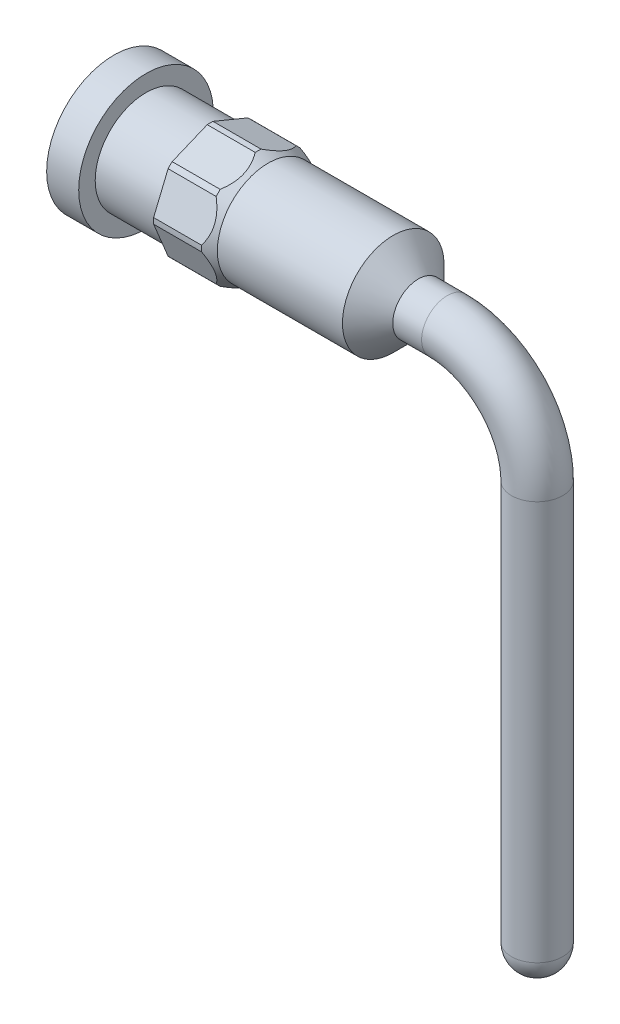
ISO-10303-21;
HEADER;
FILE_DESCRIPTION(('STEP AP214'),'2;1');
FILE_NAME('part.step','',(''),(''),'','','');
FILE_SCHEMA(('AUTOMOTIVE_DESIGN { 1 0 10303 214 1 1 1 1 }'));
ENDSEC;
DATA;
#1=APPLICATION_CONTEXT('core data for automotive mechanical design processes');
#2=APPLICATION_PROTOCOL_DEFINITION('international standard','automotive_design',2000,#1);
#3=PRODUCT_CONTEXT('',#1,'mechanical');
#4=PRODUCT('Part','Part','',(#3));
#5=PRODUCT_RELATED_PRODUCT_CATEGORY('part','',(#4));
#6=PRODUCT_DEFINITION_FORMATION('','',#4);
#7=PRODUCT_DEFINITION_CONTEXT('part definition',#1,'design');
#8=PRODUCT_DEFINITION('design','',#6,#7);
#9=PRODUCT_DEFINITION_SHAPE('','',#8);
#10=(LENGTH_UNIT() NAMED_UNIT(*) SI_UNIT(.MILLI.,.METRE.));
#11=(NAMED_UNIT(*) PLANE_ANGLE_UNIT() SI_UNIT($,.RADIAN.));
#12=(NAMED_UNIT(*) SI_UNIT($,.STERADIAN.) SOLID_ANGLE_UNIT());
#13=UNCERTAINTY_MEASURE_WITH_UNIT(LENGTH_MEASURE(1.E-05),#10,'distance_accuracy_value','');
#14=(GEOMETRIC_REPRESENTATION_CONTEXT(3) GLOBAL_UNCERTAINTY_ASSIGNED_CONTEXT((#13)) GLOBAL_UNIT_ASSIGNED_CONTEXT((#10,
#11,#12)) REPRESENTATION_CONTEXT('',''));
#15=CARTESIAN_POINT('',(0.,0.,0.));
#16=DIRECTION('',(0.,0.,1.));
#17=DIRECTION('',(1.,0.,0.));
#18=AXIS2_PLACEMENT_3D('',#15,#16,#17);
#19=CARTESIAN_POINT('',(0.,0.,0.));
#20=DIRECTION('',(-1.,0.,0.));
#21=DIRECTION('',(0.,0.,1.));
#22=AXIS2_PLACEMENT_3D('',#19,#20,#21);
#23=CYLINDRICAL_SURFACE('',#22,0.4445);
#24=CARTESIAN_POINT('',(0.,0.,0.));
#25=DIRECTION('',(-1.,0.,0.));
#26=DIRECTION('',(0.,0.,1.));
#27=AXIS2_PLACEMENT_3D('',#24,#25,#26);
#28=CIRCLE('',#27,0.4445);
#29=CARTESIAN_POINT('',(0.,0.,0.4445));
#30=VERTEX_POINT('',#29);
#31=EDGE_CURVE('E174',#30,#30,#28,.T.);
#32=ORIENTED_EDGE('',*,*,#31,.T.);
#33=EDGE_LOOP('',(#32));
#34=FACE_BOUND('',#33,.T.);
#35=CARTESIAN_POINT('',(0.000254000000005083,0.,0.));
#36=DIRECTION('',(-1.,0.,0.));
#37=DIRECTION('',(0.,0.,1.));
#38=AXIS2_PLACEMENT_3D('',#35,#36,#37);
#39=CIRCLE('',#38,0.4445);
#40=CARTESIAN_POINT('',(0.000254000000005083,0.,0.4445));
#41=VERTEX_POINT('',#40);
#42=EDGE_CURVE('E170',#41,#41,#39,.T.);
#43=ORIENTED_EDGE('',*,*,#42,.F.);
#44=EDGE_LOOP('',(#43));
#45=FACE_BOUND('',#44,.T.);
#46=ADVANCED_FACE('F16',(#34,#45),#23,.F.);
#47=CARTESIAN_POINT('',(0.000254000000005083,0.,0.));
#48=DIRECTION('',(-1.,0.,0.));
#49=DIRECTION('',(0.,0.,1.));
#50=AXIS2_PLACEMENT_3D('',#47,#48,#49);
#51=CONICAL_SURFACE('',#50,0.4445,1.15191730631627);
#52=ORIENTED_EDGE('',*,*,#42,.T.);
#53=EDGE_LOOP('',(#52));
#54=FACE_BOUND('',#53,.T.);
#55=CARTESIAN_POINT('',(0.198158150619643,0.,0.));
#56=VERTEX_POINT('',#55);
#57=VERTEX_LOOP('',#56);
#58=FACE_BOUND('',#57,.T.);
#59=ADVANCED_FACE('F355',(#54,#58),#51,.F.);
#60=CARTESIAN_POINT('',(3.35404934226463,-3.87688919235702,0.));
#61=DIRECTION('',(0.,1.,0.));
#62=DIRECTION('',(1.,0.,0.));
#63=AXIS2_PLACEMENT_3D('',#60,#61,#62);
#64=SPHERICAL_SURFACE('',#63,0.2032);
#65=CARTESIAN_POINT('',(3.35404934226463,-3.87688919235702,0.));
#66=DIRECTION('',(0.,1.,0.));
#67=DIRECTION('',(0.,0.,1.));
#68=AXIS2_PLACEMENT_3D('',#65,#66,#67);
#69=CIRCLE('',#68,0.2032);
#70=CARTESIAN_POINT('',(3.35404934226463,-3.87688919235702,0.2032));
#71=VERTEX_POINT('',#70);
#72=EDGE_CURVE('E201',#71,#71,#69,.T.);
#73=ORIENTED_EDGE('',*,*,#72,.F.);
#74=EDGE_LOOP('',(#73));
#75=FACE_BOUND('',#74,.T.);
#76=ADVANCED_FACE('F358',(#75),#64,.T.);
#77=CARTESIAN_POINT('',(0.,0.,0.));
#78=DIRECTION('',(-1.,0.,0.));
#79=DIRECTION('',(0.,0.,1.));
#80=AXIS2_PLACEMENT_3D('',#77,#78,#79);
#81=CYLINDRICAL_SURFACE('',#80,0.5334);
#82=CARTESIAN_POINT('',(0.,0.,0.));
#83=DIRECTION('',(-1.,0.,0.));
#84=DIRECTION('',(0.,0.,1.));
#85=AXIS2_PLACEMENT_3D('',#82,#83,#84);
#86=CIRCLE('',#85,0.5334);
#87=CARTESIAN_POINT('',(0.,0.,0.5334));
#88=VERTEX_POINT('',#87);
#89=EDGE_CURVE('E188',#88,#88,#86,.T.);
#90=ORIENTED_EDGE('',*,*,#89,.F.);
#91=EDGE_LOOP('',(#90));
#92=FACE_BOUND('',#91,.T.);
#93=CARTESIAN_POINT('',(0.254,0.,0.));
#94=DIRECTION('',(-1.,0.,0.));
#95=DIRECTION('',(0.,0.,1.));
#96=AXIS2_PLACEMENT_3D('',#93,#94,#95);
#97=CIRCLE('',#96,0.5334);
#98=CARTESIAN_POINT('',(0.254,0.,0.5334));
#99=VERTEX_POINT('',#98);
#100=EDGE_CURVE('E11',#99,#99,#97,.T.);
#101=ORIENTED_EDGE('',*,*,#100,.T.);
#102=EDGE_LOOP('',(#101));
#103=FACE_BOUND('',#102,.T.);
#104=ADVANCED_FACE('F362',(#92,#103),#81,.T.);
#105=CARTESIAN_POINT('',(0.,0.,0.));
#106=DIRECTION('',(-1.,0.,0.));
#107=DIRECTION('',(0.,0.,1.));
#108=AXIS2_PLACEMENT_3D('',#105,#106,#107);
#109=CYLINDRICAL_SURFACE('',#108,0.40259);
#110=CARTESIAN_POINT('',(0.254,0.,0.));
#111=DIRECTION('',(-1.,0.,0.));
#112=DIRECTION('',(0.,0.,1.));
#113=AXIS2_PLACEMENT_3D('',#110,#111,#112);
#114=CIRCLE('',#113,0.40259);
#115=CARTESIAN_POINT('',(0.254,0.,0.40259));
#116=VERTEX_POINT('',#115);
#117=EDGE_CURVE('E190',#116,#116,#114,.T.);
#118=ORIENTED_EDGE('',*,*,#117,.F.);
#119=EDGE_LOOP('',(#118));
#120=FACE_BOUND('',#119,.T.);
#121=CARTESIAN_POINT('',(0.762,0.,0.));
#122=DIRECTION('',(-1.,0.,0.));
#123=DIRECTION('',(0.,0.,1.));
#124=AXIS2_PLACEMENT_3D('',#121,#122,#123);
#125=CIRCLE('',#124,0.40259);
#126=CARTESIAN_POINT('',(0.762,0.,0.40259));
#127=VERTEX_POINT('',#126);
#128=EDGE_CURVE('E25',#127,#127,#125,.T.);
#129=ORIENTED_EDGE('',*,*,#128,.T.);
#130=EDGE_LOOP('',(#129));
#131=FACE_BOUND('',#130,.T.);
#132=ADVANCED_FACE('F366',(#120,#131),#109,.T.);
#133=CARTESIAN_POINT('',(0.,0.,0.));
#134=DIRECTION('',(-1.,0.,0.));
#135=DIRECTION('',(0.,0.,1.));
#136=AXIS2_PLACEMENT_3D('',#133,#134,#135);
#137=CYLINDRICAL_SURFACE('',#136,0.40259);
#138=CARTESIAN_POINT('',(1.22218936292205,0.,0.));
#139=DIRECTION('',(-1.,0.,0.));
#140=DIRECTION('',(0.,0.,1.));
#141=AXIS2_PLACEMENT_3D('',#138,#139,#140);
#142=CIRCLE('',#141,0.40259);
#143=CARTESIAN_POINT('',(1.22218936292205,0.,0.40259));
#144=VERTEX_POINT('',#143);
#145=EDGE_CURVE('E204',#144,#144,#142,.T.);
#146=ORIENTED_EDGE('',*,*,#145,.F.);
#147=EDGE_LOOP('',(#146));
#148=FACE_BOUND('',#147,.T.);
#149=CARTESIAN_POINT('',(2.21361000000001,0.,0.));
#150=DIRECTION('',(-1.,0.,0.));
#151=DIRECTION('',(0.,0.,1.));
#152=AXIS2_PLACEMENT_3D('',#149,#150,#151);
#153=CIRCLE('',#152,0.40259);
#154=CARTESIAN_POINT('',(2.21361000000001,0.,0.40259));
#155=VERTEX_POINT('',#154);
#156=EDGE_CURVE('E497',#155,#155,#153,.T.);
#157=ORIENTED_EDGE('',*,*,#156,.T.);
#158=EDGE_LOOP('',(#157));
#159=FACE_BOUND('',#158,.T.);
#160=ADVANCED_FACE('F369',(#148,#159),#137,.T.);
#161=CARTESIAN_POINT('',(2.413,0.,0.));
#162=DIRECTION('',(-1.,0.,0.));
#163=DIRECTION('',(0.,0.,1.));
#164=AXIS2_PLACEMENT_3D('',#161,#162,#163);
#165=CONICAL_SURFACE('',#164,0.2032,0.785398163397482);
#166=ORIENTED_EDGE('',*,*,#156,.F.);
#167=EDGE_LOOP('',(#166));
#168=FACE_BOUND('',#167,.T.);
#169=CARTESIAN_POINT('',(2.413,0.,0.));
#170=DIRECTION('',(-1.,0.,0.));
#171=DIRECTION('',(0.,0.,1.));
#172=AXIS2_PLACEMENT_3D('',#169,#170,#171);
#173=CIRCLE('',#172,0.2032);
#174=CARTESIAN_POINT('',(2.413,0.,0.2032));
#175=VERTEX_POINT('',#174);
#176=EDGE_CURVE('E494',#175,#175,#173,.T.);
#177=ORIENTED_EDGE('',*,*,#176,.T.);
#178=EDGE_LOOP('',(#177));
#179=FACE_BOUND('',#178,.T.);
#180=ADVANCED_FACE('F373',(#168,#179),#165,.T.);
#181=CARTESIAN_POINT('',(0.,0.,0.));
#182=DIRECTION('',(-1.,0.,0.));
#183=DIRECTION('',(0.,0.,1.));
#184=AXIS2_PLACEMENT_3D('',#181,#182,#183);
#185=CYLINDRICAL_SURFACE('',#184,0.2032);
#186=ORIENTED_EDGE('',*,*,#176,.F.);
#187=EDGE_LOOP('',(#186));
#188=FACE_BOUND('',#187,.T.);
#189=CARTESIAN_POINT('',(2.6416,0.,0.));
#190=DIRECTION('',(1.,0.,0.));
#191=DIRECTION('',(0.,0.,-1.));
#192=AXIS2_PLACEMENT_3D('',#189,#190,#191);
#193=CIRCLE('',#192,0.2032);
#194=CARTESIAN_POINT('',(2.6416,0.,-0.2032));
#195=VERTEX_POINT('',#194);
#196=EDGE_CURVE('E515',#195,#195,#193,.T.);
#197=ORIENTED_EDGE('',*,*,#196,.F.);
#198=EDGE_LOOP('',(#197));
#199=FACE_BOUND('',#198,.T.);
#200=ADVANCED_FACE('F377',(#188,#199),#185,.T.);
#201=CARTESIAN_POINT('',(0.,0.,0.));
#202=DIRECTION('',(-1.,0.,0.));
#203=DIRECTION('',(0.,0.,1.));
#204=AXIS2_PLACEMENT_3D('',#201,#202,#203);
#205=CYLINDRICAL_SURFACE('',#204,0.44831);
#206=CARTESIAN_POINT('',(1.143,0.,0.));
#207=DIRECTION('',(-1.,0.,0.));
#208=DIRECTION('',(0.,0.,1.));
#209=AXIS2_PLACEMENT_3D('',#206,#207,#208);
#210=CIRCLE('',#209,0.44831);
#211=CARTESIAN_POINT('',(1.14300000000003,-0.0228718140413616,0.447726184427993));
#212=VERTEX_POINT('',#211);
#213=CARTESIAN_POINT('',(1.143,0.0228718140413354,0.447726184428003));
#214=VERTEX_POINT('',#213);
#215=EDGE_CURVE('E498',#212,#214,#210,.T.);
#216=ORIENTED_EDGE('',*,*,#215,.T.);
#217=DIRECTION('',(1.,0.,0.));
#218=VECTOR('',#217,1.);
#219=CARTESIAN_POINT('',(0.,0.0228718140413354,0.447726184428003));
#220=LINE('',#219,#218);
#221=CARTESIAN_POINT('',(0.762,0.0228718140413353,0.447726184428003));
#222=VERTEX_POINT('',#221);
#223=EDGE_CURVE('E241',#222,#214,#220,.T.);
#224=ORIENTED_EDGE('',*,*,#223,.F.);
#225=CARTESIAN_POINT('',(0.762,0.,0.));
#226=DIRECTION('',(-1.,0.,0.));
#227=DIRECTION('',(0.,0.,1.));
#228=AXIS2_PLACEMENT_3D('',#225,#226,#227);
#229=CIRCLE('',#228,0.44831);
#230=CARTESIAN_POINT('',(0.762,-0.0228718140413354,0.447726184428003));
#231=VERTEX_POINT('',#230);
#232=EDGE_CURVE('E544',#231,#222,#229,.T.);
#233=ORIENTED_EDGE('',*,*,#232,.F.);
#234=DIRECTION('',(-1.,0.,0.));
#235=VECTOR('',#234,1.);
#236=CARTESIAN_POINT('',(0.,-0.0228718140413352,0.447726184428003));
#237=LINE('',#236,#235);
#238=EDGE_CURVE('E247',#212,#231,#237,.T.);
#239=ORIENTED_EDGE('',*,*,#238,.F.);
#240=EDGE_LOOP('',(#216,#224,#233,#239));
#241=FACE_BOUND('',#240,.T.);
#242=ADVANCED_FACE('F381',(#241),#205,.T.);
#243=CARTESIAN_POINT('',(1.22218936292205,0.,0.));
#244=DIRECTION('',(-1.,0.,0.));
#245=DIRECTION('',(0.,0.,1.));
#246=AXIS2_PLACEMENT_3D('',#243,#244,#245);
#247=CONICAL_SURFACE('',#246,0.40259,0.5235987755983);
#248=CARTESIAN_POINT('',(1.1428,0.0225537367665679,0.447857936349095));
#249=CARTESIAN_POINT('',(1.15133836455819,0.0360915781047003,0.442250378861585));
#250=CARTESIAN_POINT('',(1.15908581815794,0.0501767398483044,0.436416113839166));
#251=CARTESIAN_POINT('',(1.17226154281517,0.0793527987208934,0.424330994557543));
#252=CARTESIAN_POINT('',(1.17767203909986,0.0944504286604582,0.418077351476886));
#253=CARTESIAN_POINT('',(1.18461982724055,0.122653952610235,0.406395069350174));
#254=CARTESIAN_POINT('',(1.18666873841047,0.135646857310801,0.401013232008578));
#255=CARTESIAN_POINT('',(1.18828627734047,0.161705011543212,0.390219591115104));
#256=CARTESIAN_POINT('',(1.1878666594503,0.174769622753827,0.384808051964535));
#257=CARTESIAN_POINT('',(1.18464145187548,0.20060540169707,0.374106521931771));
#258=CARTESIAN_POINT('',(1.18184149660076,0.213377189306117,0.368816274288355));
#259=CARTESIAN_POINT('',(1.17421928417415,0.238422317482839,0.358442242526184));
#260=CARTESIAN_POINT('',(1.16938933242707,0.250693564555191,0.353359325561585));
#261=CARTESIAN_POINT('',(1.15762640066654,0.27573476338979,0.342986921386213));
#262=CARTESIAN_POINT('',(1.1505388760669,0.28844386176851,0.337722640472213));
#263=CARTESIAN_POINT('',(1.14280000000071,0.300735483592317,0.332631284009231));
#264=B_SPLINE_CURVE_WITH_KNOTS('',3,(#248,#249,#250,#251,#252,#253,#254,#255,#256,#257,#258,
#259,#260,#261,#262,#263),.UNSPECIFIED.,.F.,.F.,(4,2,2,2,2,2,2,4),(0.,0.0510312383952522,
0.102444060819983,0.144872487119729,0.187099046800389,0.229225930944933,0.2715139558029,
0.317760709644603),.UNSPECIFIED.);
#265=CARTESIAN_POINT('',(1.14300000000003,0.300417406317128,0.332763035930497));
#266=VERTEX_POINT('',#265);
#267=EDGE_CURVE('E210',#214,#266,#264,.T.);
#268=ORIENTED_EDGE('',*,*,#267,.F.);
#269=ORIENTED_EDGE('',*,*,#215,.F.);
#270=CARTESIAN_POINT('',(1.14279999999995,-0.300735483592008,0.332631284009359));
#271=CARTESIAN_POINT('',(1.15133836455814,-0.287197642253873,0.338238841496869));
#272=CARTESIAN_POINT('',(1.1590858181579,-0.273112480510265,0.34407310651929));
#273=CARTESIAN_POINT('',(1.17226154281514,-0.243936421637668,0.356158225800916));
#274=CARTESIAN_POINT('',(1.17767203909983,-0.228838791698098,0.362411868881576));
#275=CARTESIAN_POINT('',(1.18461982724054,-0.200635267748316,0.37409415100829));
#276=CARTESIAN_POINT('',(1.18666873841046,-0.187642363047751,0.379475988349885));
#277=CARTESIAN_POINT('',(1.18828627734047,-0.161584208815339,0.39026962924336));
#278=CARTESIAN_POINT('',(1.1878666594503,-0.148519597604723,0.395681168393929));
#279=CARTESIAN_POINT('',(1.18464145187549,-0.122683818661478,0.406382698426694));
#280=CARTESIAN_POINT('',(1.18184149660077,-0.109912031052431,0.41167294607011));
#281=CARTESIAN_POINT('',(1.17421928417417,-0.0848669028757053,0.422046977832283));
#282=CARTESIAN_POINT('',(1.16938933242709,-0.0725956558033523,0.427129894796882));
#283=CARTESIAN_POINT('',(1.15762640066657,-0.0475544569687641,0.43750229897225));
#284=CARTESIAN_POINT('',(1.15053887606694,-0.034845358590055,0.442766579886245));
#285=CARTESIAN_POINT('',(1.14280000000077,-0.0225537367662595,0.447857936349222));
#286=B_SPLINE_CURVE_WITH_KNOTS('',3,(#270,#271,#272,#273,#274,#275,#276,#277,#278,#279,#280,
#281,#282,#283,#284,#285),.UNSPECIFIED.,.F.,.F.,(4,2,2,2,2,2,2,4),(0.,0.0510312383952718,
0.102444060820023,0.144872487119771,0.187099046800432,0.229225930944979,0.271513955802947,
0.317760709644604),.UNSPECIFIED.);
#287=CARTESIAN_POINT('',(1.143,-0.300417406317154,0.332763035930486));
#288=VERTEX_POINT('',#287);
#289=EDGE_CURVE('E253',#288,#212,#286,.T.);
#290=ORIENTED_EDGE('',*,*,#289,.F.);
#291=CARTESIAN_POINT('',(1.143,0.,0.));
#292=DIRECTION('',(-1.,0.,0.));
#293=DIRECTION('',(0.,0.,1.));
#294=AXIS2_PLACEMENT_3D('',#291,#292,#293);
#295=CIRCLE('',#294,0.44831);
#296=CARTESIAN_POINT('',(1.14300000000003,-0.332763035930497,0.300417406317128));
#297=VERTEX_POINT('',#296);
#298=EDGE_CURVE('E511',#297,#288,#295,.T.);
#299=ORIENTED_EDGE('',*,*,#298,.F.);
#300=CARTESIAN_POINT('',(1.1428,-0.447857936349095,0.0225537367665677));
#301=CARTESIAN_POINT('',(1.15133836455819,-0.442250378861585,0.0360915781047001));
#302=CARTESIAN_POINT('',(1.15908581815794,-0.436416113839166,0.0501767398483042));
#303=CARTESIAN_POINT('',(1.17226154281517,-0.424330994557543,0.0793527987208933));
#304=CARTESIAN_POINT('',(1.17767203909986,-0.418077351476886,0.0944504286604582));
#305=CARTESIAN_POINT('',(1.18461982724055,-0.406395069350174,0.122653952610235));
#306=CARTESIAN_POINT('',(1.18666873841047,-0.401013232008578,0.135646857310801));
#307=CARTESIAN_POINT('',(1.18828627734047,-0.390219591115104,0.161705011543212));
#308=CARTESIAN_POINT('',(1.1878666594503,-0.384808051964535,0.174769622753827));
#309=CARTESIAN_POINT('',(1.18464145187548,-0.374106521931771,0.20060540169707));
#310=CARTESIAN_POINT('',(1.18184149660076,-0.368816274288355,0.213377189306116));
#311=CARTESIAN_POINT('',(1.17421928417415,-0.358442242526184,0.238422317482839));
#312=CARTESIAN_POINT('',(1.16938933242707,-0.353359325561585,0.250693564555191));
#313=CARTESIAN_POINT('',(1.15762640066654,-0.342986921386213,0.27573476338979));
#314=CARTESIAN_POINT('',(1.1505388760669,-0.337722640472213,0.28844386176851));
#315=CARTESIAN_POINT('',(1.14280000000071,-0.332631284009231,0.300735483592317));
#316=B_SPLINE_CURVE_WITH_KNOTS('',3,(#300,#301,#302,#303,#304,#305,#306,#307,#308,#309,#310,
#311,#312,#313,#314,#315),.UNSPECIFIED.,.F.,.F.,(4,2,2,2,2,2,2,4),(0.,0.0510312383952524,
0.102444060819983,0.144872487119729,0.187099046800389,0.229225930944934,0.2715139558029,
0.317760709644604),.UNSPECIFIED.);
#317=CARTESIAN_POINT('',(1.143,-0.447726184428003,0.022871814041335));
#318=VERTEX_POINT('',#317);
#319=EDGE_CURVE('E250',#318,#297,#316,.T.);
#320=ORIENTED_EDGE('',*,*,#319,.F.);
#321=CARTESIAN_POINT('',(1.143,0.,0.));
#322=DIRECTION('',(-1.,0.,0.));
#323=DIRECTION('',(0.,0.,1.));
#324=AXIS2_PLACEMENT_3D('',#321,#322,#323);
#325=CIRCLE('',#324,0.44831);
#326=CARTESIAN_POINT('',(1.14300000000003,-0.447726184427993,-0.0228718140413611));
#327=VERTEX_POINT('',#326);
#328=EDGE_CURVE('E529',#327,#318,#325,.T.);
#329=ORIENTED_EDGE('',*,*,#328,.F.);
#330=CARTESIAN_POINT('',(1.14279999999995,-0.332631284009358,-0.300735483592009));
#331=CARTESIAN_POINT('',(1.15133836455814,-0.338238841496869,-0.287197642253873));
#332=CARTESIAN_POINT('',(1.1590858181579,-0.34407310651929,-0.273112480510265));
#333=CARTESIAN_POINT('',(1.17226154281514,-0.356158225800916,-0.243936421637668));
#334=CARTESIAN_POINT('',(1.17767203909983,-0.362411868881576,-0.228838791698098));
#335=CARTESIAN_POINT('',(1.18461982724054,-0.37409415100829,-0.200635267748316));
#336=CARTESIAN_POINT('',(1.18666873841046,-0.379475988349885,-0.18764236304775));
#337=CARTESIAN_POINT('',(1.18828627734047,-0.39026962924336,-0.161584208815339));
#338=CARTESIAN_POINT('',(1.1878666594503,-0.395681168393929,-0.148519597604723));
#339=CARTESIAN_POINT('',(1.18464145187549,-0.406382698426694,-0.122683818661478));
#340=CARTESIAN_POINT('',(1.18184149660077,-0.41167294607011,-0.109912031052431));
#341=CARTESIAN_POINT('',(1.17421928417417,-0.422046977832282,-0.0848669028757053));
#342=CARTESIAN_POINT('',(1.16938933242709,-0.427129894796882,-0.0725956558033523));
#343=CARTESIAN_POINT('',(1.15762640066657,-0.43750229897225,-0.047554456968764));
#344=CARTESIAN_POINT('',(1.15053887606694,-0.442766579886245,-0.0348453585900548));
#345=CARTESIAN_POINT('',(1.14280000000077,-0.447857936349222,-0.0225537367662592));
#346=B_SPLINE_CURVE_WITH_KNOTS('',3,(#330,#331,#332,#333,#334,#335,#336,#337,#338,#339,#340,
#341,#342,#343,#344,#345),.UNSPECIFIED.,.F.,.F.,(4,2,2,2,2,2,2,4),(0.,0.0510312383952721,
0.102444060820024,0.144872487119771,0.187099046800432,0.229225930944979,0.271513955802948,
0.317760709644604),.UNSPECIFIED.);
#347=CARTESIAN_POINT('',(1.143,-0.332763035930486,-0.300417406317155));
#348=VERTEX_POINT('',#347);
#349=EDGE_CURVE('E295',#348,#327,#346,.T.);
#350=ORIENTED_EDGE('',*,*,#349,.F.);
#351=CARTESIAN_POINT('',(1.143,0.,0.));
#352=DIRECTION('',(-1.,0.,0.));
#353=DIRECTION('',(0.,0.,1.));
#354=AXIS2_PLACEMENT_3D('',#351,#352,#353);
#355=CIRCLE('',#354,0.44831);
#356=CARTESIAN_POINT('',(1.14300000000003,-0.300417406317128,-0.332763035930497));
#357=VERTEX_POINT('',#356);
#358=EDGE_CURVE('E524',#357,#348,#355,.T.);
#359=ORIENTED_EDGE('',*,*,#358,.F.);
#360=CARTESIAN_POINT('',(1.1428,-0.0225537367665679,-0.447857936349095));
#361=CARTESIAN_POINT('',(1.15133836455819,-0.0360915781047004,-0.442250378861585));
#362=CARTESIAN_POINT('',(1.15908581815794,-0.0501767398483045,-0.436416113839166));
#363=CARTESIAN_POINT('',(1.17226154281517,-0.0793527987208936,-0.424330994557543));
#364=CARTESIAN_POINT('',(1.17767203909986,-0.0944504286604585,-0.418077351476885));
#365=CARTESIAN_POINT('',(1.18461982724055,-0.122653952610235,-0.406395069350174));
#366=CARTESIAN_POINT('',(1.18666873841047,-0.135646857310801,-0.401013232008578));
#367=CARTESIAN_POINT('',(1.18828627734047,-0.161705011543212,-0.390219591115104));
#368=CARTESIAN_POINT('',(1.1878666594503,-0.174769622753828,-0.384808051964535));
#369=CARTESIAN_POINT('',(1.18464145187548,-0.20060540169707,-0.374106521931771));
#370=CARTESIAN_POINT('',(1.18184149660076,-0.213377189306117,-0.368816274288355));
#371=CARTESIAN_POINT('',(1.17421928417415,-0.23842231748284,-0.358442242526184));
#372=CARTESIAN_POINT('',(1.16938933242707,-0.250693564555191,-0.353359325561585));
#373=CARTESIAN_POINT('',(1.15762640066654,-0.27573476338979,-0.342986921386213));
#374=CARTESIAN_POINT('',(1.1505388760669,-0.28844386176851,-0.337722640472213));
#375=CARTESIAN_POINT('',(1.14280000000071,-0.300735483592317,-0.332631284009231));
#376=B_SPLINE_CURVE_WITH_KNOTS('',3,(#360,#361,#362,#363,#364,#365,#366,#367,#368,#369,#370,
#371,#372,#373,#374,#375),.UNSPECIFIED.,.F.,.F.,(4,2,2,2,2,2,2,4),(0.,0.0510312383952524,
0.102444060819983,0.144872487119729,0.187099046800389,0.229225930944934,0.2715139558029,
0.317760709644603),.UNSPECIFIED.);
#377=CARTESIAN_POINT('',(1.143,-0.0228718140413353,-0.447726184428003));
#378=VERTEX_POINT('',#377);
#379=EDGE_CURVE('E291',#378,#357,#376,.T.);
#380=ORIENTED_EDGE('',*,*,#379,.F.);
#381=CARTESIAN_POINT('',(1.143,0.,0.));
#382=DIRECTION('',(-1.,0.,0.));
#383=DIRECTION('',(0.,0.,1.));
#384=AXIS2_PLACEMENT_3D('',#381,#382,#383);
#385=CIRCLE('',#384,0.44831);
#386=CARTESIAN_POINT('',(1.14300000000003,0.0228718140413616,-0.447726184427993));
#387=VERTEX_POINT('',#386);
#388=EDGE_CURVE('E520',#387,#378,#385,.T.);
#389=ORIENTED_EDGE('',*,*,#388,.F.);
#390=CARTESIAN_POINT('',(1.14279999999995,0.300735483592008,-0.332631284009359));
#391=CARTESIAN_POINT('',(1.15133836455814,0.287197642253873,-0.33823884149687));
#392=CARTESIAN_POINT('',(1.1590858181579,0.273112480510265,-0.344073106519291));
#393=CARTESIAN_POINT('',(1.17226154281514,0.243936421637668,-0.356158225800916));
#394=CARTESIAN_POINT('',(1.17767203909983,0.228838791698098,-0.362411868881576));
#395=CARTESIAN_POINT('',(1.18461982724054,0.200635267748316,-0.37409415100829));
#396=CARTESIAN_POINT('',(1.18666873841046,0.18764236304775,-0.379475988349886));
#397=CARTESIAN_POINT('',(1.18828627734047,0.161584208815339,-0.39026962924336));
#398=CARTESIAN_POINT('',(1.1878666594503,0.148519597604723,-0.395681168393929));
#399=CARTESIAN_POINT('',(1.18464145187549,0.122683818661478,-0.406382698426694));
#400=CARTESIAN_POINT('',(1.18184149660077,0.109912031052431,-0.41167294607011));
#401=CARTESIAN_POINT('',(1.17421928417417,0.0848669028757051,-0.422046977832283));
#402=CARTESIAN_POINT('',(1.16938933242709,0.0725956558033521,-0.427129894796882));
#403=CARTESIAN_POINT('',(1.15762640066657,0.047554456968764,-0.43750229897225));
#404=CARTESIAN_POINT('',(1.15053887606694,0.034845358590055,-0.442766579886245));
#405=CARTESIAN_POINT('',(1.14280000000077,0.0225537367662595,-0.447857936349222));
#406=B_SPLINE_CURVE_WITH_KNOTS('',3,(#390,#391,#392,#393,#394,#395,#396,#397,#398,#399,#400,
#401,#402,#403,#404,#405),.UNSPECIFIED.,.F.,.F.,(4,2,2,2,2,2,2,4),(0.,0.0510312383952719,
0.102444060820023,0.144872487119771,0.187099046800432,0.229225930944979,0.271513955802947,
0.317760709644603),.UNSPECIFIED.);
#407=CARTESIAN_POINT('',(1.143,0.300417406317154,-0.332763035930486));
#408=VERTEX_POINT('',#407);
#409=EDGE_CURVE('E335',#408,#387,#406,.T.);
#410=ORIENTED_EDGE('',*,*,#409,.F.);
#411=CARTESIAN_POINT('',(1.143,0.,0.));
#412=DIRECTION('',(-1.,0.,0.));
#413=DIRECTION('',(0.,0.,1.));
#414=AXIS2_PLACEMENT_3D('',#411,#412,#413);
#415=CIRCLE('',#414,0.44831);
#416=CARTESIAN_POINT('',(1.14300000000003,0.332763035930497,-0.300417406317128));
#417=VERTEX_POINT('',#416);
#418=EDGE_CURVE('E148',#417,#408,#415,.T.);
#419=ORIENTED_EDGE('',*,*,#418,.F.);
#420=CARTESIAN_POINT('',(1.1428,0.447857936349095,-0.0225537367665682));
#421=CARTESIAN_POINT('',(1.15133836455819,0.442250378861585,-0.0360915781047005));
#422=CARTESIAN_POINT('',(1.15908581815794,0.436416113839166,-0.0501767398483046));
#423=CARTESIAN_POINT('',(1.17226154281517,0.424330994557543,-0.0793527987208937));
#424=CARTESIAN_POINT('',(1.17767203909986,0.418077351476886,-0.0944504286604586));
#425=CARTESIAN_POINT('',(1.18461982724055,0.406395069350174,-0.122653952610235));
#426=CARTESIAN_POINT('',(1.18666873841047,0.401013232008578,-0.135646857310801));
#427=CARTESIAN_POINT('',(1.18828627734047,0.390219591115104,-0.161705011543212));
#428=CARTESIAN_POINT('',(1.1878666594503,0.384808051964535,-0.174769622753828));
#429=CARTESIAN_POINT('',(1.18464145187548,0.374106521931771,-0.200605401697071));
#430=CARTESIAN_POINT('',(1.18184149660076,0.368816274288355,-0.213377189306117));
#431=CARTESIAN_POINT('',(1.17421928417415,0.358442242526184,-0.23842231748284));
#432=CARTESIAN_POINT('',(1.16938933242707,0.353359325561585,-0.250693564555191));
#433=CARTESIAN_POINT('',(1.15762640066654,0.342986921386213,-0.27573476338979));
#434=CARTESIAN_POINT('',(1.1505388760669,0.337722640472213,-0.28844386176851));
#435=CARTESIAN_POINT('',(1.14280000000071,0.332631284009231,-0.300735483592316));
#436=B_SPLINE_CURVE_WITH_KNOTS('',3,(#420,#421,#422,#423,#424,#425,#426,#427,#428,#429,#430,
#431,#432,#433,#434,#435),.UNSPECIFIED.,.F.,.F.,(4,2,2,2,2,2,2,4),(0.,0.0510312383952522,
0.102444060819983,0.144872487119729,0.187099046800389,0.229225930944933,0.2715139558029,
0.317760709644603),.UNSPECIFIED.);
#437=CARTESIAN_POINT('',(1.143,0.447726184428003,-0.0228718140413354));
#438=VERTEX_POINT('',#437);
#439=EDGE_CURVE('E155',#438,#417,#436,.T.);
#440=ORIENTED_EDGE('',*,*,#439,.F.);
#441=CARTESIAN_POINT('',(1.143,0.,0.));
#442=DIRECTION('',(-1.,0.,0.));
#443=DIRECTION('',(0.,0.,1.));
#444=AXIS2_PLACEMENT_3D('',#441,#442,#443);
#445=CIRCLE('',#444,0.44831);
#446=CARTESIAN_POINT('',(1.14300000000003,0.447726184427993,0.0228718140413619));
#447=VERTEX_POINT('',#446);
#448=EDGE_CURVE('E154',#447,#438,#445,.T.);
#449=ORIENTED_EDGE('',*,*,#448,.F.);
#450=CARTESIAN_POINT('',(1.14279999999995,0.332631284009359,0.300735483592008));
#451=CARTESIAN_POINT('',(1.15133836455814,0.33823884149687,0.287197642253873));
#452=CARTESIAN_POINT('',(1.1590858181579,0.344073106519291,0.273112480510265));
#453=CARTESIAN_POINT('',(1.17226154281514,0.356158225800916,0.243936421637668));
#454=CARTESIAN_POINT('',(1.17767203909983,0.362411868881576,0.228838791698098));
#455=CARTESIAN_POINT('',(1.18461982724054,0.37409415100829,0.200635267748316));
#456=CARTESIAN_POINT('',(1.18666873841046,0.379475988349886,0.18764236304775));
#457=CARTESIAN_POINT('',(1.18828627734047,0.39026962924336,0.161584208815339));
#458=CARTESIAN_POINT('',(1.1878666594503,0.395681168393929,0.148519597604723));
#459=CARTESIAN_POINT('',(1.18464145187549,0.406382698426694,0.122683818661478));
#460=CARTESIAN_POINT('',(1.18184149660077,0.41167294607011,0.109912031052431));
#461=CARTESIAN_POINT('',(1.17421928417417,0.422046977832283,0.0848669028757051));
#462=CARTESIAN_POINT('',(1.16938933242709,0.427129894796882,0.0725956558033521));
#463=CARTESIAN_POINT('',(1.15762640066657,0.43750229897225,0.0475544569687641));
#464=CARTESIAN_POINT('',(1.15053887606694,0.442766579886245,0.0348453585900552));
#465=CARTESIAN_POINT('',(1.14280000000077,0.447857936349222,0.0225537367662598));
#466=B_SPLINE_CURVE_WITH_KNOTS('',3,(#450,#451,#452,#453,#454,#455,#456,#457,#458,#459,#460,
#461,#462,#463,#464,#465),.UNSPECIFIED.,.F.,.F.,(4,2,2,2,2,2,2,4),(0.,0.0510312383952719,
0.102444060820023,0.144872487119771,0.187099046800432,0.229225930944979,0.271513955802947,
0.317760709644603),.UNSPECIFIED.);
#467=CARTESIAN_POINT('',(1.143,0.332763035930486,0.300417406317154));
#468=VERTEX_POINT('',#467);
#469=EDGE_CURVE('E173',#468,#447,#466,.T.);
#470=ORIENTED_EDGE('',*,*,#469,.F.);
#471=CARTESIAN_POINT('',(1.143,0.,0.));
#472=DIRECTION('',(-1.,0.,0.));
#473=DIRECTION('',(0.,0.,1.));
#474=AXIS2_PLACEMENT_3D('',#471,#472,#473);
#475=CIRCLE('',#474,0.44831);
#476=EDGE_CURVE('E509',#266,#468,#475,.T.);
#477=ORIENTED_EDGE('',*,*,#476,.F.);
#478=EDGE_LOOP('',(#268,#269,#290,#299,#320,#329,#350,#359,#380,#389,#410,#419,#440,#449,#470,#477));
#479=FACE_BOUND('',#478,.T.);
#480=ORIENTED_EDGE('',*,*,#145,.T.);
#481=EDGE_LOOP('',(#480));
#482=FACE_BOUND('',#481,.T.);
#483=ADVANCED_FACE('F385',(#479,#482),#247,.T.);
#484=CARTESIAN_POINT('',(2.6416,-0.712449342264639,0.));
#485=DIRECTION('',(0.,0.,-1.));
#486=DIRECTION('',(0.,1.,0.));
#487=AXIS2_PLACEMENT_3D('',#484,#485,#486);
#488=TOROIDAL_SURFACE('',#487,0.712449342264639,0.2032);
#489=ORIENTED_EDGE('',*,*,#196,.T.);
#490=EDGE_LOOP('',(#489));
#491=FACE_BOUND('',#490,.T.);
#492=CARTESIAN_POINT('',(3.35404934226464,-0.712449342264641,0.));
#493=DIRECTION('',(0.,-1.,0.));
#494=DIRECTION('',(0.,0.,-1.));
#495=AXIS2_PLACEMENT_3D('',#492,#493,#494);
#496=CIRCLE('',#495,0.2032);
#497=CARTESIAN_POINT('',(3.35404934226464,-0.712449342264641,-0.2032));
#498=VERTEX_POINT('',#497);
#499=EDGE_CURVE('E205',#498,#498,#496,.T.);
#500=ORIENTED_EDGE('',*,*,#499,.F.);
#501=EDGE_LOOP('',(#500));
#502=FACE_BOUND('',#501,.T.);
#503=ADVANCED_FACE('F389',(#491,#502),#488,.T.);
#504=CARTESIAN_POINT('',(3.35404934226465,3.10811080764298,0.));
#505=DIRECTION('',(0.,1.,0.));
#506=DIRECTION('',(0.,0.,1.));
#507=AXIS2_PLACEMENT_3D('',#504,#505,#506);
#508=CYLINDRICAL_SURFACE('',#507,0.2032);
#509=ORIENTED_EDGE('',*,*,#499,.T.);
#510=EDGE_LOOP('',(#509));
#511=FACE_BOUND('',#510,.T.);
#512=ORIENTED_EDGE('',*,*,#72,.T.);
#513=EDGE_LOOP('',(#512));
#514=FACE_BOUND('',#513,.T.);
#515=ADVANCED_FACE('F393',(#511,#514),#508,.T.);
#516=CARTESIAN_POINT('',(0.,0.,0.));
#517=DIRECTION('',(-1.,0.,0.));
#518=DIRECTION('',(0.,0.,1.));
#519=AXIS2_PLACEMENT_3D('',#516,#517,#518);
#520=CYLINDRICAL_SURFACE('',#519,0.44831);
#521=DIRECTION('',(-1.,0.,0.));
#522=VECTOR('',#521,1.);
#523=CARTESIAN_POINT('',(0.,0.447726184428003,0.0228718140413355));
#524=LINE('',#523,#522);
#525=CARTESIAN_POINT('',(0.762,0.447726184428003,0.0228718140413355));
#526=VERTEX_POINT('',#525);
#527=EDGE_CURVE('E208',#447,#526,#524,.T.);
#528=ORIENTED_EDGE('',*,*,#527,.F.);
#529=ORIENTED_EDGE('',*,*,#448,.T.);
#530=DIRECTION('',(1.,0.,0.));
#531=VECTOR('',#530,1.);
#532=CARTESIAN_POINT('',(0.,0.447726184428003,-0.0228718140413354));
#533=LINE('',#532,#531);
#534=CARTESIAN_POINT('',(0.762,0.447726184428003,-0.0228718140413353));
#535=VERTEX_POINT('',#534);
#536=EDGE_CURVE('E136',#535,#438,#533,.T.);
#537=ORIENTED_EDGE('',*,*,#536,.F.);
#538=CARTESIAN_POINT('',(0.762,0.,0.));
#539=DIRECTION('',(-1.,0.,0.));
#540=DIRECTION('',(0.,0.,1.));
#541=AXIS2_PLACEMENT_3D('',#538,#539,#540);
#542=CIRCLE('',#541,0.44831);
#543=EDGE_CURVE('E142',#526,#535,#542,.T.);
#544=ORIENTED_EDGE('',*,*,#543,.F.);
#545=EDGE_LOOP('',(#528,#529,#537,#544));
#546=FACE_BOUND('',#545,.T.);
#547=ADVANCED_FACE('F152',(#546),#520,.T.);
#548=CARTESIAN_POINT('',(0.,0.,0.));
#549=DIRECTION('',(-1.,0.,0.));
#550=DIRECTION('',(0.,0.,1.));
#551=AXIS2_PLACEMENT_3D('',#548,#549,#550);
#552=CYLINDRICAL_SURFACE('',#551,0.44831);
#553=DIRECTION('',(1.,0.,0.));
#554=VECTOR('',#553,1.);
#555=CARTESIAN_POINT('',(0.,0.332763035930486,0.300417406317154));
#556=LINE('',#555,#554);
#557=CARTESIAN_POINT('',(0.762,0.332763035930486,0.300417406317154));
#558=VERTEX_POINT('',#557);
#559=EDGE_CURVE('E215',#558,#468,#556,.T.);
#560=ORIENTED_EDGE('',*,*,#559,.F.);
#561=CARTESIAN_POINT('',(0.762,0.,0.));
#562=DIRECTION('',(-1.,0.,0.));
#563=DIRECTION('',(0.,0.,1.));
#564=AXIS2_PLACEMENT_3D('',#561,#562,#563);
#565=CIRCLE('',#564,0.44831);
#566=CARTESIAN_POINT('',(0.762,0.300417406317154,0.332763035930486));
#567=VERTEX_POINT('',#566);
#568=EDGE_CURVE('E193',#567,#558,#565,.T.);
#569=ORIENTED_EDGE('',*,*,#568,.F.);
#570=DIRECTION('',(-1.,0.,0.));
#571=VECTOR('',#570,1.);
#572=CARTESIAN_POINT('',(0.,0.300417406317154,0.332763035930486));
#573=LINE('',#572,#571);
#574=EDGE_CURVE('E257',#266,#567,#573,.T.);
#575=ORIENTED_EDGE('',*,*,#574,.F.);
#576=ORIENTED_EDGE('',*,*,#476,.T.);
#577=EDGE_LOOP('',(#560,#569,#575,#576));
#578=FACE_BOUND('',#577,.T.);
#579=ADVANCED_FACE('F400',(#578),#552,.T.);
#580=CARTESIAN_POINT('',(0.,0.,0.));
#581=DIRECTION('',(-1.,0.,0.));
#582=DIRECTION('',(0.,0.,1.));
#583=AXIS2_PLACEMENT_3D('',#580,#581,#582);
#584=CYLINDRICAL_SURFACE('',#583,0.44831);
#585=DIRECTION('',(1.,0.,0.));
#586=VECTOR('',#585,1.);
#587=CARTESIAN_POINT('',(0.,-0.300417406317154,0.332763035930486));
#588=LINE('',#587,#586);
#589=CARTESIAN_POINT('',(0.762,-0.300417406317154,0.332763035930486));
#590=VERTEX_POINT('',#589);
#591=EDGE_CURVE('E256',#590,#288,#588,.T.);
#592=ORIENTED_EDGE('',*,*,#591,.F.);
#593=CARTESIAN_POINT('',(0.762,0.,0.));
#594=DIRECTION('',(-1.,0.,0.));
#595=DIRECTION('',(0.,0.,1.));
#596=AXIS2_PLACEMENT_3D('',#593,#594,#595);
#597=CIRCLE('',#596,0.44831);
#598=CARTESIAN_POINT('',(0.762,-0.332763035930486,0.300417406317154));
#599=VERTEX_POINT('',#598);
#600=EDGE_CURVE('E565',#599,#590,#597,.T.);
#601=ORIENTED_EDGE('',*,*,#600,.F.);
#602=DIRECTION('',(-1.,0.,0.));
#603=VECTOR('',#602,1.);
#604=CARTESIAN_POINT('',(0.,-0.332763035930486,0.300417406317154));
#605=LINE('',#604,#603);
#606=EDGE_CURVE('E299',#297,#599,#605,.T.);
#607=ORIENTED_EDGE('',*,*,#606,.F.);
#608=ORIENTED_EDGE('',*,*,#298,.T.);
#609=EDGE_LOOP('',(#592,#601,#607,#608));
#610=FACE_BOUND('',#609,.T.);
#611=ADVANCED_FACE('F403',(#610),#584,.T.);
#612=CARTESIAN_POINT('',(0.,0.,0.));
#613=DIRECTION('',(-1.,0.,0.));
#614=DIRECTION('',(0.,0.,1.));
#615=AXIS2_PLACEMENT_3D('',#612,#613,#614);
#616=CYLINDRICAL_SURFACE('',#615,0.44831);
#617=DIRECTION('',(1.,0.,0.));
#618=VECTOR('',#617,1.);
#619=CARTESIAN_POINT('',(0.,-0.447726184428003,0.022871814041335));
#620=LINE('',#619,#618);
#621=CARTESIAN_POINT('',(0.762,-0.447726184428003,0.022871814041335));
#622=VERTEX_POINT('',#621);
#623=EDGE_CURVE('E282',#622,#318,#620,.T.);
#624=ORIENTED_EDGE('',*,*,#623,.F.);
#625=CARTESIAN_POINT('',(0.762,0.,0.));
#626=DIRECTION('',(-1.,0.,0.));
#627=DIRECTION('',(0.,0.,1.));
#628=AXIS2_PLACEMENT_3D('',#625,#626,#627);
#629=CIRCLE('',#628,0.44831);
#630=CARTESIAN_POINT('',(0.762,-0.447726184428003,-0.0228718140413346));
#631=VERTEX_POINT('',#630);
#632=EDGE_CURVE('E560',#631,#622,#629,.T.);
#633=ORIENTED_EDGE('',*,*,#632,.F.);
#634=DIRECTION('',(-1.,0.,0.));
#635=VECTOR('',#634,1.);
#636=CARTESIAN_POINT('',(0.,-0.447726184428003,-0.0228718140413346));
#637=LINE('',#636,#635);
#638=EDGE_CURVE('E288',#327,#631,#637,.T.);
#639=ORIENTED_EDGE('',*,*,#638,.F.);
#640=ORIENTED_EDGE('',*,*,#328,.T.);
#641=EDGE_LOOP('',(#624,#633,#639,#640));
#642=FACE_BOUND('',#641,.T.);
#643=ADVANCED_FACE('F407',(#642),#616,.T.);
#644=CARTESIAN_POINT('',(0.,0.,0.));
#645=DIRECTION('',(-1.,0.,0.));
#646=DIRECTION('',(0.,0.,1.));
#647=AXIS2_PLACEMENT_3D('',#644,#645,#646);
#648=CYLINDRICAL_SURFACE('',#647,0.44831);
#649=DIRECTION('',(1.,0.,0.));
#650=VECTOR('',#649,1.);
#651=CARTESIAN_POINT('',(0.,-0.332763035930486,-0.300417406317155));
#652=LINE('',#651,#650);
#653=CARTESIAN_POINT('',(0.762,-0.332763035930486,-0.300417406317155));
#654=VERTEX_POINT('',#653);
#655=EDGE_CURVE('E298',#654,#348,#652,.T.);
#656=ORIENTED_EDGE('',*,*,#655,.F.);
#657=CARTESIAN_POINT('',(0.762,0.,0.));
#658=DIRECTION('',(-1.,0.,0.));
#659=DIRECTION('',(0.,0.,1.));
#660=AXIS2_PLACEMENT_3D('',#657,#658,#659);
#661=CIRCLE('',#660,0.44831);
#662=CARTESIAN_POINT('',(0.762,-0.300417406317154,-0.332763035930486));
#663=VERTEX_POINT('',#662);
#664=EDGE_CURVE('E555',#663,#654,#661,.T.);
#665=ORIENTED_EDGE('',*,*,#664,.F.);
#666=DIRECTION('',(-1.,0.,0.));
#667=VECTOR('',#666,1.);
#668=CARTESIAN_POINT('',(0.,-0.300417406317154,-0.332763035930486));
#669=LINE('',#668,#667);
#670=EDGE_CURVE('E339',#357,#663,#669,.T.);
#671=ORIENTED_EDGE('',*,*,#670,.F.);
#672=ORIENTED_EDGE('',*,*,#358,.T.);
#673=EDGE_LOOP('',(#656,#665,#671,#672));
#674=FACE_BOUND('',#673,.T.);
#675=ADVANCED_FACE('F411',(#674),#648,.T.);
#676=CARTESIAN_POINT('',(0.,0.,0.));
#677=DIRECTION('',(-1.,0.,0.));
#678=DIRECTION('',(0.,0.,1.));
#679=AXIS2_PLACEMENT_3D('',#676,#677,#678);
#680=CYLINDRICAL_SURFACE('',#679,0.44831);
#681=DIRECTION('',(1.,0.,0.));
#682=VECTOR('',#681,1.);
#683=CARTESIAN_POINT('',(0.,-0.0228718140413353,-0.447726184428003));
#684=LINE('',#683,#682);
#685=CARTESIAN_POINT('',(0.762,-0.0228718140413353,-0.447726184428003));
#686=VERTEX_POINT('',#685);
#687=EDGE_CURVE('E324',#686,#378,#684,.T.);
#688=ORIENTED_EDGE('',*,*,#687,.F.);
#689=CARTESIAN_POINT('',(0.762,0.,0.));
#690=DIRECTION('',(-1.,0.,0.));
#691=DIRECTION('',(0.,0.,1.));
#692=AXIS2_PLACEMENT_3D('',#689,#690,#691);
#693=CIRCLE('',#692,0.44831);
#694=CARTESIAN_POINT('',(0.762,0.0228718140413356,-0.447726184428003));
#695=VERTEX_POINT('',#694);
#696=EDGE_CURVE('E550',#695,#686,#693,.T.);
#697=ORIENTED_EDGE('',*,*,#696,.F.);
#698=DIRECTION('',(-1.,0.,0.));
#699=VECTOR('',#698,1.);
#700=CARTESIAN_POINT('',(0.,0.0228718140413353,-0.447726184428003));
#701=LINE('',#700,#699);
#702=EDGE_CURVE('E157',#387,#695,#701,.T.);
#703=ORIENTED_EDGE('',*,*,#702,.F.);
#704=ORIENTED_EDGE('',*,*,#388,.T.);
#705=EDGE_LOOP('',(#688,#697,#703,#704));
#706=FACE_BOUND('',#705,.T.);
#707=ADVANCED_FACE('F415',(#706),#680,.T.);
#708=CARTESIAN_POINT('',(0.,0.,0.));
#709=DIRECTION('',(-1.,0.,0.));
#710=DIRECTION('',(0.,0.,1.));
#711=AXIS2_PLACEMENT_3D('',#708,#709,#710);
#712=CYLINDRICAL_SURFACE('',#711,0.44831);
#713=DIRECTION('',(1.,0.,0.));
#714=VECTOR('',#713,1.);
#715=CARTESIAN_POINT('',(0.,0.300417406317154,-0.332763035930486));
#716=LINE('',#715,#714);
#717=CARTESIAN_POINT('',(0.762,0.300417406317154,-0.332763035930486));
#718=VERTEX_POINT('',#717);
#719=EDGE_CURVE('E338',#718,#408,#716,.T.);
#720=ORIENTED_EDGE('',*,*,#719,.F.);
#721=CARTESIAN_POINT('',(0.762,0.,0.));
#722=DIRECTION('',(-1.,0.,0.));
#723=DIRECTION('',(0.,0.,1.));
#724=AXIS2_PLACEMENT_3D('',#721,#722,#723);
#725=CIRCLE('',#724,0.44831);
#726=CARTESIAN_POINT('',(0.762,0.332763035930486,-0.300417406317154));
#727=VERTEX_POINT('',#726);
#728=EDGE_CURVE('E149',#727,#718,#725,.T.);
#729=ORIENTED_EDGE('',*,*,#728,.F.);
#730=DIRECTION('',(-1.,0.,0.));
#731=VECTOR('',#730,1.);
#732=CARTESIAN_POINT('',(0.,0.332763035930486,-0.300417406317154));
#733=LINE('',#732,#731);
#734=EDGE_CURVE('E137',#417,#727,#733,.T.);
#735=ORIENTED_EDGE('',*,*,#734,.F.);
#736=ORIENTED_EDGE('',*,*,#418,.T.);
#737=EDGE_LOOP('',(#720,#729,#735,#736));
#738=FACE_BOUND('',#737,.T.);
#739=ADVANCED_FACE('F419',(#738),#712,.T.);
#740=CARTESIAN_POINT('',(0.762,0.40259,0.));
#741=DIRECTION('',(1.,0.,0.));
#742=DIRECTION('',(0.,0.,-1.));
#743=AXIS2_PLACEMENT_3D('',#740,#741,#742);
#744=PLANE('',#743);
#745=ORIENTED_EDGE('',*,*,#128,.F.);
#746=EDGE_LOOP('',(#745));
#747=FACE_BOUND('',#746,.T.);
#748=DIRECTION('',(0.,-0.38268343236509,0.923879532511287));
#749=VECTOR('',#748,1.);
#750=CARTESIAN_POINT('',(0.762,0.449202550660299,0.0193075506602987));
#751=LINE('',#750,#749);
#752=EDGE_CURVE('E145',#526,#558,#751,.T.);
#753=ORIENTED_EDGE('',*,*,#752,.F.);
#754=ORIENTED_EDGE('',*,*,#543,.T.);
#755=DIRECTION('',(0.,0.38268343236509,0.923879532511287));
#756=VECTOR('',#755,1.);
#757=CARTESIAN_POINT('',(0.762,0.449202550660299,-0.0193075506602987));
#758=LINE('',#757,#756);
#759=EDGE_CURVE('E131',#727,#535,#758,.T.);
#760=ORIENTED_EDGE('',*,*,#759,.F.);
#761=ORIENTED_EDGE('',*,*,#728,.T.);
#762=DIRECTION('',(0.,0.923879532511287,0.38268343236509));
#763=VECTOR('',#762,1.);
#764=CARTESIAN_POINT('',(0.762,0.505276669698191,-0.247907550660299));
#765=LINE('',#764,#763);
#766=EDGE_CURVE('E332',#695,#718,#765,.T.);
#767=ORIENTED_EDGE('',*,*,#766,.F.);
#768=ORIENTED_EDGE('',*,*,#696,.T.);
#769=DIRECTION('',(0.,0.923879532511287,-0.38268343236509));
#770=VECTOR('',#769,1.);
#771=CARTESIAN_POINT('',(0.762,0.181987449339701,-0.532581669698191));
#772=LINE('',#771,#770);
#773=EDGE_CURVE('E327',#663,#686,#772,.T.);
#774=ORIENTED_EDGE('',*,*,#773,.F.);
#775=ORIENTED_EDGE('',*,*,#664,.T.);
#776=DIRECTION('',(0.,0.38268343236509,-0.923879532511287));
#777=VECTOR('',#776,1.);
#778=CARTESIAN_POINT('',(0.762,-0.331286669698191,-0.303981669698191));
#779=LINE('',#778,#777);
#780=EDGE_CURVE('E292',#631,#654,#779,.T.);
#781=ORIENTED_EDGE('',*,*,#780,.F.);
#782=ORIENTED_EDGE('',*,*,#632,.T.);
#783=DIRECTION('',(0.,-0.38268343236509,-0.923879532511287));
#784=VECTOR('',#783,1.);
#785=CARTESIAN_POINT('',(0.762,-0.331286669698191,0.303981669698191));
#786=LINE('',#785,#784);
#787=EDGE_CURVE('E285',#599,#622,#786,.T.);
#788=ORIENTED_EDGE('',*,*,#787,.F.);
#789=ORIENTED_EDGE('',*,*,#600,.T.);
#790=DIRECTION('',(0.,-0.923879532511287,-0.38268343236509));
#791=VECTOR('',#790,1.);
#792=CARTESIAN_POINT('',(0.762,0.181987449339701,0.532581669698191));
#793=LINE('',#792,#791);
#794=EDGE_CURVE('E37',#231,#590,#793,.T.);
#795=ORIENTED_EDGE('',*,*,#794,.F.);
#796=ORIENTED_EDGE('',*,*,#232,.T.);
#797=DIRECTION('',(0.,-0.923879532511287,0.38268343236509));
#798=VECTOR('',#797,1.);
#799=CARTESIAN_POINT('',(0.762,0.505276669698191,0.247907550660299));
#800=LINE('',#799,#798);
#801=EDGE_CURVE('E244',#567,#222,#800,.T.);
#802=ORIENTED_EDGE('',*,*,#801,.F.);
#803=ORIENTED_EDGE('',*,*,#568,.T.);
#804=EDGE_LOOP('',(#753,#754,#760,#761,#767,#768,#774,#775,#781,#782,#788,#789,#795,#796,#802,#803));
#805=FACE_BOUND('',#804,.T.);
#806=ADVANCED_FACE('F143',(#747,#805),#744,.F.);
#807=CARTESIAN_POINT('',(0.254,0.5334,0.));
#808=DIRECTION('',(-1.,0.,0.));
#809=DIRECTION('',(0.,0.,1.));
#810=AXIS2_PLACEMENT_3D('',#807,#808,#809);
#811=PLANE('',#810);
#812=ORIENTED_EDGE('',*,*,#100,.F.);
#813=EDGE_LOOP('',(#812));
#814=FACE_BOUND('',#813,.T.);
#815=ORIENTED_EDGE('',*,*,#117,.T.);
#816=EDGE_LOOP('',(#815));
#817=FACE_BOUND('',#816,.T.);
#818=ADVANCED_FACE('F184',(#814,#817),#811,.F.);
#819=CARTESIAN_POINT('',(0.,0.,0.));
#820=DIRECTION('',(1.,0.,0.));
#821=DIRECTION('',(0.,0.,-1.));
#822=AXIS2_PLACEMENT_3D('',#819,#820,#821);
#823=PLANE('',#822);
#824=ORIENTED_EDGE('',*,*,#31,.F.);
#825=EDGE_LOOP('',(#824));
#826=FACE_BOUND('',#825,.T.);
#827=ORIENTED_EDGE('',*,*,#89,.T.);
#828=EDGE_LOOP('',(#827));
#829=FACE_BOUND('',#828,.T.);
#830=ADVANCED_FACE('F181',(#826,#829),#823,.F.);
#831=CARTESIAN_POINT('',(1.2192,0.4572,0.));
#832=DIRECTION('',(0.,0.923879532511287,-0.38268343236509));
#833=DIRECTION('',(0.,0.38268343236509,0.923879532511287));
#834=AXIS2_PLACEMENT_3D('',#831,#832,#833);
#835=PLANE('',#834);
#836=ORIENTED_EDGE('',*,*,#734,.T.);
#837=ORIENTED_EDGE('',*,*,#759,.T.);
#838=ORIENTED_EDGE('',*,*,#536,.T.);
#839=ORIENTED_EDGE('',*,*,#439,.T.);
#840=EDGE_LOOP('',(#836,#837,#838,#839));
#841=FACE_BOUND('',#840,.T.);
#842=ADVANCED_FACE('F133',(#841),#835,.T.);
#843=CARTESIAN_POINT('',(1.2192,0.32328922035849,-0.323289220358489));
#844=DIRECTION('',(0.,0.38268343236509,-0.923879532511287));
#845=DIRECTION('',(0.,0.923879532511287,0.38268343236509));
#846=AXIS2_PLACEMENT_3D('',#843,#844,#845);
#847=PLANE('',#846);
#848=ORIENTED_EDGE('',*,*,#702,.T.);
#849=ORIENTED_EDGE('',*,*,#766,.T.);
#850=ORIENTED_EDGE('',*,*,#719,.T.);
#851=ORIENTED_EDGE('',*,*,#409,.T.);
#852=EDGE_LOOP('',(#848,#849,#850,#851));
#853=FACE_BOUND('',#852,.T.);
#854=ADVANCED_FACE('F432',(#853),#847,.T.);
#855=CARTESIAN_POINT('',(1.2192,0.,-0.4572));
#856=DIRECTION('',(0.,-0.38268343236509,-0.923879532511287));
#857=DIRECTION('',(0.,0.923879532511287,-0.38268343236509));
#858=AXIS2_PLACEMENT_3D('',#855,#856,#857);
#859=PLANE('',#858);
#860=ORIENTED_EDGE('',*,*,#670,.T.);
#861=ORIENTED_EDGE('',*,*,#773,.T.);
#862=ORIENTED_EDGE('',*,*,#687,.T.);
#863=ORIENTED_EDGE('',*,*,#379,.T.);
#864=EDGE_LOOP('',(#860,#861,#862,#863));
#865=FACE_BOUND('',#864,.T.);
#866=ADVANCED_FACE('F435',(#865),#859,.T.);
#867=CARTESIAN_POINT('',(1.2192,-0.323289220358489,-0.32328922035849));
#868=DIRECTION('',(0.,-0.923879532511287,-0.38268343236509));
#869=DIRECTION('',(0.,0.38268343236509,-0.923879532511287));
#870=AXIS2_PLACEMENT_3D('',#867,#868,#869);
#871=PLANE('',#870);
#872=ORIENTED_EDGE('',*,*,#638,.T.);
#873=ORIENTED_EDGE('',*,*,#780,.T.);
#874=ORIENTED_EDGE('',*,*,#655,.T.);
#875=ORIENTED_EDGE('',*,*,#349,.T.);
#876=EDGE_LOOP('',(#872,#873,#874,#875));
#877=FACE_BOUND('',#876,.T.);
#878=ADVANCED_FACE('F439',(#877),#871,.T.);
#879=CARTESIAN_POINT('',(1.2192,-0.4572,0.));
#880=DIRECTION('',(0.,-0.923879532511287,0.38268343236509));
#881=DIRECTION('',(0.,-0.38268343236509,-0.923879532511287));
#882=AXIS2_PLACEMENT_3D('',#879,#880,#881);
#883=PLANE('',#882);
#884=ORIENTED_EDGE('',*,*,#606,.T.);
#885=ORIENTED_EDGE('',*,*,#787,.T.);
#886=ORIENTED_EDGE('',*,*,#623,.T.);
#887=ORIENTED_EDGE('',*,*,#319,.T.);
#888=EDGE_LOOP('',(#884,#885,#886,#887));
#889=FACE_BOUND('',#888,.T.);
#890=ADVANCED_FACE('F443',(#889),#883,.T.);
#891=CARTESIAN_POINT('',(1.2192,-0.323289220358489,0.323289220358489));
#892=DIRECTION('',(0.,-0.38268343236509,0.923879532511287));
#893=DIRECTION('',(0.,-0.923879532511287,-0.38268343236509));
#894=AXIS2_PLACEMENT_3D('',#891,#892,#893);
#895=PLANE('',#894);
#896=ORIENTED_EDGE('',*,*,#238,.T.);
#897=ORIENTED_EDGE('',*,*,#794,.T.);
#898=ORIENTED_EDGE('',*,*,#591,.T.);
#899=ORIENTED_EDGE('',*,*,#289,.T.);
#900=EDGE_LOOP('',(#896,#897,#898,#899));
#901=FACE_BOUND('',#900,.T.);
#902=ADVANCED_FACE('F447',(#901),#895,.T.);
#903=CARTESIAN_POINT('',(1.2192,0.,0.4572));
#904=DIRECTION('',(0.,0.38268343236509,0.923879532511287));
#905=DIRECTION('',(0.,-0.923879532511287,0.38268343236509));
#906=AXIS2_PLACEMENT_3D('',#903,#904,#905);
#907=PLANE('',#906);
#908=ORIENTED_EDGE('',*,*,#574,.T.);
#909=ORIENTED_EDGE('',*,*,#801,.T.);
#910=ORIENTED_EDGE('',*,*,#223,.T.);
#911=ORIENTED_EDGE('',*,*,#267,.T.);
#912=EDGE_LOOP('',(#908,#909,#910,#911));
#913=FACE_BOUND('',#912,.T.);
#914=ADVANCED_FACE('F450',(#913),#907,.T.);
#915=CARTESIAN_POINT('',(1.2192,0.323289220358489,0.323289220358489));
#916=DIRECTION('',(0.,0.923879532511287,0.38268343236509));
#917=DIRECTION('',(0.,-0.38268343236509,0.923879532511287));
#918=AXIS2_PLACEMENT_3D('',#915,#916,#917);
#919=PLANE('',#918);
#920=ORIENTED_EDGE('',*,*,#527,.T.);
#921=ORIENTED_EDGE('',*,*,#752,.T.);
#922=ORIENTED_EDGE('',*,*,#559,.T.);
#923=ORIENTED_EDGE('',*,*,#469,.T.);
#924=EDGE_LOOP('',(#920,#921,#922,#923));
#925=FACE_BOUND('',#924,.T.);
#926=ADVANCED_FACE('F18',(#925),#919,.T.);
#927=CLOSED_SHELL('',(#46,#59,#76,#104,#132,#160,#180,#200,#242,#483,#503,#515,#547,#579,#611,
#643,#675,#707,#739,#806,#818,#830,#842,#854,#866,#878,#890,#902,#914,#926));
#928=MANIFOLD_SOLID_BREP('B1',#927);
#929=ADVANCED_BREP_SHAPE_REPRESENTATION('',(#18,#928),#14);
#930=SHAPE_DEFINITION_REPRESENTATION(#9,#929);
ENDSEC;
END-ISO-10303-21;
